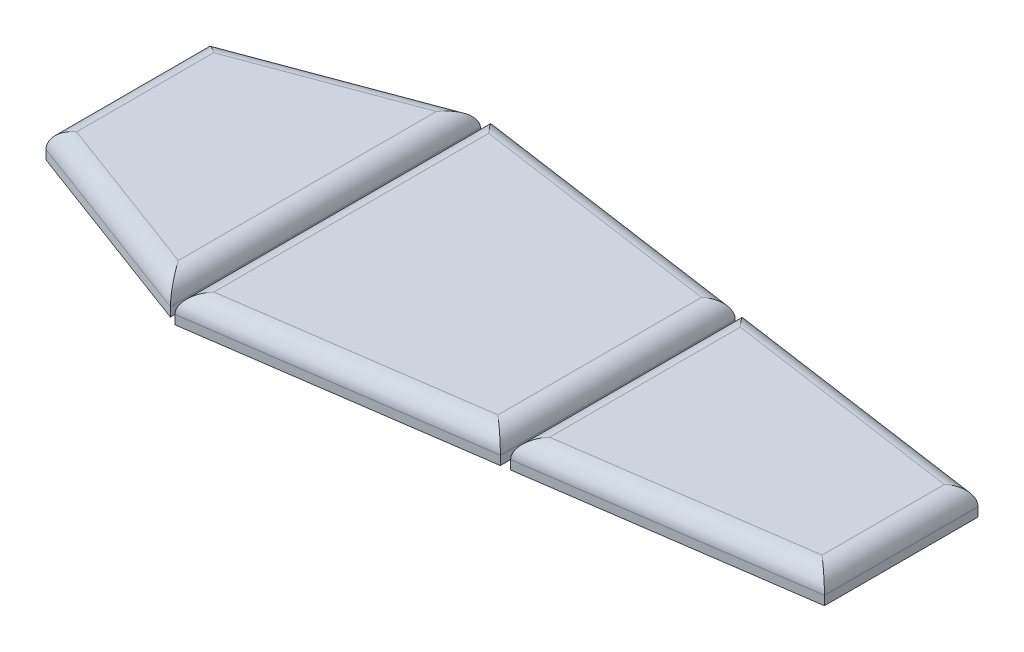
ISO-10303-21;
HEADER;
FILE_DESCRIPTION(('STEP AP214'),'2;1');
FILE_NAME('part.step','',(''),(''),'','','');
FILE_SCHEMA(('AUTOMOTIVE_DESIGN { 1 0 10303 214 1 1 1 1 }'));
ENDSEC;
DATA;
#1=APPLICATION_CONTEXT('core data for automotive mechanical design processes');
#2=APPLICATION_PROTOCOL_DEFINITION('international standard','automotive_design',2000,#1);
#3=PRODUCT_CONTEXT('',#1,'mechanical');
#4=PRODUCT('Part','Part','',(#3));
#5=PRODUCT_RELATED_PRODUCT_CATEGORY('part','',(#4));
#6=PRODUCT_DEFINITION_FORMATION('','',#4);
#7=PRODUCT_DEFINITION_CONTEXT('part definition',#1,'design');
#8=PRODUCT_DEFINITION('design','',#6,#7);
#9=PRODUCT_DEFINITION_SHAPE('','',#8);
#10=(LENGTH_UNIT() NAMED_UNIT(*) SI_UNIT(.MILLI.,.METRE.));
#11=(NAMED_UNIT(*) PLANE_ANGLE_UNIT() SI_UNIT($,.RADIAN.));
#12=(NAMED_UNIT(*) SI_UNIT($,.STERADIAN.) SOLID_ANGLE_UNIT());
#13=UNCERTAINTY_MEASURE_WITH_UNIT(LENGTH_MEASURE(1.E-05),#10,'distance_accuracy_value','');
#14=(GEOMETRIC_REPRESENTATION_CONTEXT(3) GLOBAL_UNCERTAINTY_ASSIGNED_CONTEXT((#13)) GLOBAL_UNIT_ASSIGNED_CONTEXT((#10,
#11,#12)) REPRESENTATION_CONTEXT('',''));
#15=CARTESIAN_POINT('',(0.,0.,0.));
#16=DIRECTION('',(0.,0.,1.));
#17=DIRECTION('',(1.,0.,0.));
#18=AXIS2_PLACEMENT_3D('',#15,#16,#17);
#19=CARTESIAN_POINT('',(1036.27166865944,90.4875,-224.07477234005));
#20=DIRECTION('',(-0.141933027229114,0.,0.98987626286399));
#21=DIRECTION('',(0.98987626286399,0.,0.141933027229114));
#22=AXIS2_PLACEMENT_3D('',#19,#20,#21);
#23=PLANE('',#22);
#24=DIRECTION('',(0.,-1.,0.));
#25=VECTOR('',#24,1.);
#26=CARTESIAN_POINT('',(263.1666865591,90.4875,-334.926132850436));
#27=LINE('',#26,#25);
#28=CARTESIAN_POINT('',(263.1666865591,39.6875,-334.926132850436));
#29=VERTEX_POINT('',#28);
#30=CARTESIAN_POINT('',(263.1666865591,14.2875,-334.926132850436));
#31=VERTEX_POINT('',#30);
#32=EDGE_CURVE('E95',#29,#31,#27,.T.);
#33=ORIENTED_EDGE('',*,*,#32,.F.);
#34=DIRECTION('',(-0.98987626286399,0.,-0.141933027229114));
#35=VECTOR('',#34,1.);
#36=CARTESIAN_POINT('',(1036.27166865944,39.6875,-224.07477234005));
#37=LINE('',#36,#35);
#38=CARTESIAN_POINT('',(1036.27166865944,39.6875,-224.07477234005));
#39=VERTEX_POINT('',#38);
#40=EDGE_CURVE('E53',#29,#39,#37,.F.);
#41=ORIENTED_EDGE('',*,*,#40,.T.);
#42=DIRECTION('',(0.,-1.,0.));
#43=VECTOR('',#42,1.);
#44=CARTESIAN_POINT('',(1036.27166865944,90.4875,-224.07477234005));
#45=LINE('',#44,#43);
#46=CARTESIAN_POINT('',(1036.27166865944,14.2875,-224.07477234005));
#47=VERTEX_POINT('',#46);
#48=EDGE_CURVE('E112',#39,#47,#45,.T.);
#49=ORIENTED_EDGE('',*,*,#48,.T.);
#50=DIRECTION('',(-0.98987626286399,0.,-0.141933027229114));
#51=VECTOR('',#50,1.);
#52=CARTESIAN_POINT('',(1036.27166865944,14.2875,-224.07477234005));
#53=LINE('',#52,#51);
#54=EDGE_CURVE('E108',#47,#31,#53,.T.);
#55=ORIENTED_EDGE('',*,*,#54,.T.);
#56=EDGE_LOOP('',(#33,#41,#49,#55));
#57=FACE_BOUND('',#56,.T.);
#58=ADVANCED_FACE('F44',(#57),#23,.F.);
#59=CARTESIAN_POINT('',(263.1666865591,90.4875,-334.926132850436));
#60=DIRECTION('',(1.,0.,0.));
#61=DIRECTION('',(0.,0.,-1.));
#62=AXIS2_PLACEMENT_3D('',#59,#60,#61);
#63=PLANE('',#62);
#64=DIRECTION('',(0.,-1.,0.));
#65=VECTOR('',#64,1.);
#66=CARTESIAN_POINT('',(263.166686559101,90.4875,319.413226746626));
#67=LINE('',#66,#65);
#68=CARTESIAN_POINT('',(263.166686559101,39.6875,319.413226746626));
#69=VERTEX_POINT('',#68);
#70=CARTESIAN_POINT('',(263.166686559101,14.2875,319.413226746626));
#71=VERTEX_POINT('',#70);
#72=EDGE_CURVE('E102',#69,#71,#67,.T.);
#73=ORIENTED_EDGE('',*,*,#72,.F.);
#74=DIRECTION('',(0.,0.,1.));
#75=VECTOR('',#74,1.);
#76=CARTESIAN_POINT('',(263.1666865591,39.6875,-334.926132850436));
#77=LINE('',#76,#75);
#78=EDGE_CURVE('E12',#69,#29,#77,.F.);
#79=ORIENTED_EDGE('',*,*,#78,.T.);
#80=ORIENTED_EDGE('',*,*,#32,.T.);
#81=DIRECTION('',(0.,0.,1.));
#82=VECTOR('',#81,1.);
#83=CARTESIAN_POINT('',(263.1666865591,14.2875,-334.926132850436));
#84=LINE('',#83,#82);
#85=EDGE_CURVE('E98',#31,#71,#84,.T.);
#86=ORIENTED_EDGE('',*,*,#85,.T.);
#87=EDGE_LOOP('',(#73,#79,#80,#86));
#88=FACE_BOUND('',#87,.T.);
#89=ADVANCED_FACE('F97',(#88),#63,.F.);
#90=CARTESIAN_POINT('',(263.166686559101,90.4875,319.413226746626));
#91=DIRECTION('',(-0.141942353510418,0.,-0.989874925573895));
#92=DIRECTION('',(-0.989874925573895,0.,0.141942353510418));
#93=AXIS2_PLACEMENT_3D('',#90,#91,#92);
#94=PLANE('',#93);
#95=DIRECTION('',(0.,-1.,0.));
#96=VECTOR('',#95,1.);
#97=CARTESIAN_POINT('',(1036.27166865944,90.4875,208.554432534488));
#98=LINE('',#97,#96);
#99=CARTESIAN_POINT('',(1036.27166865944,39.6875,208.554432534488));
#100=VERTEX_POINT('',#99);
#101=CARTESIAN_POINT('',(1036.27166865944,14.2875,208.554432534488));
#102=VERTEX_POINT('',#101);
#103=EDGE_CURVE('E122',#100,#102,#98,.T.);
#104=ORIENTED_EDGE('',*,*,#103,.F.);
#105=DIRECTION('',(0.989874925573895,0.,-0.141942353510418));
#106=VECTOR('',#105,1.);
#107=CARTESIAN_POINT('',(263.166686559101,39.6875,319.413226746626));
#108=LINE('',#107,#106);
#109=EDGE_CURVE('E133',#100,#69,#108,.F.);
#110=ORIENTED_EDGE('',*,*,#109,.T.);
#111=ORIENTED_EDGE('',*,*,#72,.T.);
#112=DIRECTION('',(0.989874925573895,0.,-0.141942353510418));
#113=VECTOR('',#112,1.);
#114=CARTESIAN_POINT('',(263.166686559101,14.2875,319.413226746626));
#115=LINE('',#114,#113);
#116=EDGE_CURVE('E110',#71,#102,#115,.T.);
#117=ORIENTED_EDGE('',*,*,#116,.T.);
#118=EDGE_LOOP('',(#104,#110,#111,#117));
#119=FACE_BOUND('',#118,.T.);
#120=ADVANCED_FACE('F162',(#119),#94,.F.);
#121=CARTESIAN_POINT('',(1036.27166865944,90.4875,208.554432534488));
#122=DIRECTION('',(-1.,0.,0.));
#123=DIRECTION('',(0.,0.,1.));
#124=AXIS2_PLACEMENT_3D('',#121,#122,#123);
#125=PLANE('',#124);
#126=ORIENTED_EDGE('',*,*,#48,.F.);
#127=DIRECTION('',(0.,0.,-1.));
#128=VECTOR('',#127,1.);
#129=CARTESIAN_POINT('',(1036.27166865944,39.6875,208.554432534488));
#130=LINE('',#129,#128);
#131=EDGE_CURVE('E136',#39,#100,#130,.F.);
#132=ORIENTED_EDGE('',*,*,#131,.T.);
#133=ORIENTED_EDGE('',*,*,#103,.T.);
#134=DIRECTION('',(0.,0.,-1.));
#135=VECTOR('',#134,1.);
#136=CARTESIAN_POINT('',(1036.27166865944,14.2875,208.554432534488));
#137=LINE('',#136,#135);
#138=EDGE_CURVE('E119',#102,#47,#137,.T.);
#139=ORIENTED_EDGE('',*,*,#138,.T.);
#140=EDGE_LOOP('',(#126,#132,#133,#139));
#141=FACE_BOUND('',#140,.T.);
#142=ADVANCED_FACE('F164',(#141),#125,.F.);
#143=CARTESIAN_POINT('',(0.,90.4875,0.));
#144=DIRECTION('',(0.,1.,0.));
#145=DIRECTION('',(0.,0.,1.));
#146=AXIS2_PLACEMENT_3D('',#143,#144,#145);
#147=PLANE('',#146);
#148=DIRECTION('',(0.,0.,1.));
#149=VECTOR('',#148,1.);
#150=CARTESIAN_POINT('',(313.966686559101,90.4875,319.413226746626));
#151=LINE('',#150,#149);
#152=CARTESIAN_POINT('',(313.9666865591,90.4875,-276.322648799411));
#153=VERTEX_POINT('',#152);
#154=CARTESIAN_POINT('',(313.966686559101,90.4875,260.809184902959));
#155=VERTEX_POINT('',#154);
#156=EDGE_CURVE('E101',#153,#155,#151,.T.);
#157=ORIENTED_EDGE('',*,*,#156,.T.);
#158=DIRECTION('',(0.989874925573895,0.,-0.141942353510418));
#159=VECTOR('',#158,1.);
#160=CARTESIAN_POINT('',(1029.06099710111,90.4875,158.268786315334));
#161=LINE('',#160,#159);
#162=CARTESIAN_POINT('',(985.471668659438,90.4875,164.519244536975));
#163=VERTEX_POINT('',#162);
#164=EDGE_CURVE('E130',#155,#163,#161,.T.);
#165=ORIENTED_EDGE('',*,*,#164,.T.);
#166=DIRECTION('',(0.,0.,-1.));
#167=VECTOR('',#166,1.);
#168=CARTESIAN_POINT('',(985.471668659438,90.4875,-224.07477234005));
#169=LINE('',#168,#167);
#170=CARTESIAN_POINT('',(985.471668659438,90.4875,-180.039165212101));
#171=VERTEX_POINT('',#170);
#172=EDGE_CURVE('E128',#163,#171,#169,.T.);
#173=ORIENTED_EDGE('',*,*,#172,.T.);
#174=DIRECTION('',(-0.98987626286399,0.,-0.141933027229114));
#175=VECTOR('',#174,1.);
#176=CARTESIAN_POINT('',(255.956488775862,90.4875,-284.640418696946));
#177=LINE('',#176,#175);
#178=EDGE_CURVE('E126',#171,#153,#177,.T.);
#179=ORIENTED_EDGE('',*,*,#178,.T.);
#180=EDGE_LOOP('',(#157,#165,#173,#179));
#181=FACE_BOUND('',#180,.T.);
#182=ADVANCED_FACE('F154',(#181),#147,.T.);
#183=CARTESIAN_POINT('',(0.,14.2875,0.));
#184=DIRECTION('',(0.,1.,0.));
#185=DIRECTION('',(0.,0.,1.));
#186=AXIS2_PLACEMENT_3D('',#183,#184,#185);
#187=PLANE('',#186);
#188=ORIENTED_EDGE('',*,*,#54,.F.);
#189=ORIENTED_EDGE('',*,*,#138,.F.);
#190=ORIENTED_EDGE('',*,*,#116,.F.);
#191=ORIENTED_EDGE('',*,*,#85,.F.);
#192=EDGE_LOOP('',(#188,#189,#190,#191));
#193=FACE_BOUND('',#192,.T.);
#194=ADVANCED_FACE('F106',(#193),#187,.F.);
#195=CARTESIAN_POINT('',(45.1471179964496,39.6875,-314.867239245625));
#196=DIRECTION('',(0.98987626286399,0.,0.141933027229114));
#197=DIRECTION('',(0.141933027229114,0.,-0.98987626286399));
#198=AXIS2_PLACEMENT_3D('',#195,#196,#197);
#199=CYLINDRICAL_SURFACE('',#198,50.8);
#200=CARTESIAN_POINT('',(985.471668659438,39.6875,-180.039165212101));
#201=DIRECTION('',(0.655006478124792,0.,0.755623261694978));
#202=DIRECTION('',(0.755623261694978,0.,-0.655006478124792));
#203=AXIS2_PLACEMENT_3D('',#200,#201,#202);
#204=ELLIPSE('',#203,67.2292696310697,50.8);
#205=EDGE_CURVE('E116',#39,#171,#204,.T.);
#206=ORIENTED_EDGE('',*,*,#205,.F.);
#207=ORIENTED_EDGE('',*,*,#40,.F.);
#208=CARTESIAN_POINT('',(313.966686559101,39.6875,-276.322648799411));
#209=DIRECTION('',(0.755623261694978,0.,-0.655006478124792));
#210=DIRECTION('',(-0.655006478124792,0.,-0.755623261694978));
#211=AXIS2_PLACEMENT_3D('',#208,#209,#210);
#212=ELLIPSE('',#211,77.5564848540652,50.8);
#213=EDGE_CURVE('E48',#153,#29,#212,.F.);
#214=ORIENTED_EDGE('',*,*,#213,.F.);
#215=ORIENTED_EDGE('',*,*,#178,.F.);
#216=EDGE_LOOP('',(#206,#207,#214,#215));
#217=FACE_BOUND('',#216,.T.);
#218=ADVANCED_FACE('F46',(#217),#199,.T.);
#219=CARTESIAN_POINT('',(313.966686559101,39.6875,0.));
#220=DIRECTION('',(0.,0.,-1.));
#221=DIRECTION('',(-1.,0.,0.));
#222=AXIS2_PLACEMENT_3D('',#219,#220,#221);
#223=CYLINDRICAL_SURFACE('',#222,50.8);
#224=ORIENTED_EDGE('',*,*,#213,.T.);
#225=ORIENTED_EDGE('',*,*,#78,.F.);
#226=CARTESIAN_POINT('',(313.966686559101,39.6875,260.809184902959));
#227=DIRECTION('',(-0.755626347314074,0.,-0.655002918500972));
#228=DIRECTION('',(0.655002918500972,0.,-0.755626347314074));
#229=AXIS2_PLACEMENT_3D('',#226,#227,#228);
#230=ELLIPSE('',#229,77.5569063360206,50.8);
#231=EDGE_CURVE('E141',#155,#69,#230,.F.);
#232=ORIENTED_EDGE('',*,*,#231,.F.);
#233=ORIENTED_EDGE('',*,*,#156,.F.);
#234=EDGE_LOOP('',(#224,#225,#232,#233));
#235=FACE_BOUND('',#234,.T.);
#236=ADVANCED_FACE('F184',(#235),#223,.T.);
#237=CARTESIAN_POINT('',(985.471668659438,39.6875,0.));
#238=DIRECTION('',(0.,0.,1.));
#239=DIRECTION('',(1.,0.,0.));
#240=AXIS2_PLACEMENT_3D('',#237,#238,#239);
#241=CYLINDRICAL_SURFACE('',#240,50.8);
#242=ORIENTED_EDGE('',*,*,#205,.T.);
#243=ORIENTED_EDGE('',*,*,#172,.F.);
#244=CARTESIAN_POINT('',(985.471668659438,39.6875,164.519244536975));
#245=DIRECTION('',(-0.655002918500972,0.,0.755626347314074));
#246=DIRECTION('',(0.755626347314074,0.,0.655002918500972));
#247=AXIS2_PLACEMENT_3D('',#244,#245,#246);
#248=ELLIPSE('',#247,67.228995098665,50.8);
#249=EDGE_CURVE('E139',#100,#163,#248,.T.);
#250=ORIENTED_EDGE('',*,*,#249,.F.);
#251=ORIENTED_EDGE('',*,*,#131,.F.);
#252=EDGE_LOOP('',(#242,#243,#250,#251));
#253=FACE_BOUND('',#252,.T.);
#254=ADVANCED_FACE('F147',(#253),#241,.T.);
#255=CARTESIAN_POINT('',(42.9707257612677,39.6875,299.668442243133));
#256=DIRECTION('',(-0.989874925573895,0.,0.141942353510418));
#257=DIRECTION('',(0.141942353510418,0.,0.989874925573895));
#258=AXIS2_PLACEMENT_3D('',#255,#256,#257);
#259=CYLINDRICAL_SURFACE('',#258,50.8);
#260=ORIENTED_EDGE('',*,*,#231,.T.);
#261=ORIENTED_EDGE('',*,*,#109,.F.);
#262=ORIENTED_EDGE('',*,*,#249,.T.);
#263=ORIENTED_EDGE('',*,*,#164,.F.);
#264=EDGE_LOOP('',(#260,#261,#262,#263));
#265=FACE_BOUND('',#264,.T.);
#266=ADVANCED_FACE('F158',(#265),#259,.T.);
#267=CLOSED_SHELL('',(#58,#89,#120,#142,#182,#194,#218,#236,#254,#266));
#268=MANIFOLD_SOLID_BREP('B2',#267);
#269=CARTESIAN_POINT('',(237.7666865591,90.4875,-338.568102081206));
#270=DIRECTION('',(-0.141933027229114,0.,0.98987626286399));
#271=DIRECTION('',(0.989876262863991,0.,0.141933027229114));
#272=AXIS2_PLACEMENT_3D('',#269,#270,#271);
#273=PLANE('',#272);
#274=DIRECTION('',(0.,-1.,0.));
#275=VECTOR('',#274,1.);
#276=CARTESIAN_POINT('',(-563.928331340562,90.4875,-453.518833878511));
#277=LINE('',#276,#275);
#278=CARTESIAN_POINT('',(-563.928331340562,39.6875,-453.518833878511));
#279=VERTEX_POINT('',#278);
#280=CARTESIAN_POINT('',(-563.928331340562,14.2875,-453.518833878511));
#281=VERTEX_POINT('',#280);
#282=EDGE_CURVE('E311',#279,#281,#277,.T.);
#283=ORIENTED_EDGE('',*,*,#282,.F.);
#284=DIRECTION('',(-0.989876262863991,0.,-0.141933027229114));
#285=VECTOR('',#284,1.);
#286=CARTESIAN_POINT('',(237.766686559101,39.6875,-338.568102081206));
#287=LINE('',#286,#285);
#288=CARTESIAN_POINT('',(237.7666865591,39.6875,-338.568102081206));
#289=VERTEX_POINT('',#288);
#290=EDGE_CURVE('E353',#279,#289,#287,.F.);
#291=ORIENTED_EDGE('',*,*,#290,.T.);
#292=DIRECTION('',(0.,-1.,0.));
#293=VECTOR('',#292,1.);
#294=CARTESIAN_POINT('',(237.7666865591,90.4875,-338.568102081206));
#295=LINE('',#294,#293);
#296=CARTESIAN_POINT('',(237.7666865591,14.2875,-338.568102081206));
#297=VERTEX_POINT('',#296);
#298=EDGE_CURVE('E332',#289,#297,#295,.T.);
#299=ORIENTED_EDGE('',*,*,#298,.T.);
#300=DIRECTION('',(-0.98987626286399,0.,-0.141933027229114));
#301=VECTOR('',#300,1.);
#302=CARTESIAN_POINT('',(237.7666865591,14.2875,-338.568102081206));
#303=LINE('',#302,#301);
#304=EDGE_CURVE('E328',#297,#281,#303,.T.);
#305=ORIENTED_EDGE('',*,*,#304,.T.);
#306=EDGE_LOOP('',(#283,#291,#299,#305));
#307=FACE_BOUND('',#306,.T.);
#308=ADVANCED_FACE('F257',(#307),#273,.F.);
#309=CARTESIAN_POINT('',(-563.928331340562,90.4875,-453.518833878511));
#310=DIRECTION('',(1.,0.,0.));
#311=DIRECTION('',(0.,0.,-1.));
#312=AXIS2_PLACEMENT_3D('',#309,#310,#311);
#313=PLANE('',#312);
#314=DIRECTION('',(0.,-1.,0.));
#315=VECTOR('',#314,1.);
#316=CARTESIAN_POINT('',(-563.928331340562,90.4875,438.013880611411));
#317=LINE('',#316,#315);
#318=CARTESIAN_POINT('',(-563.928331340562,39.6875,438.013880611411));
#319=VERTEX_POINT('',#318);
#320=CARTESIAN_POINT('',(-563.928331340562,14.2875,438.013880611411));
#321=VERTEX_POINT('',#320);
#322=EDGE_CURVE('E322',#319,#321,#317,.T.);
#323=ORIENTED_EDGE('',*,*,#322,.F.);
#324=DIRECTION('',(0.,0.,1.));
#325=VECTOR('',#324,1.);
#326=CARTESIAN_POINT('',(-563.928331340562,39.6875,-453.518833878511));
#327=LINE('',#326,#325);
#328=EDGE_CURVE('E42',#319,#279,#327,.F.);
#329=ORIENTED_EDGE('',*,*,#328,.T.);
#330=ORIENTED_EDGE('',*,*,#282,.T.);
#331=DIRECTION('',(0.,0.,1.));
#332=VECTOR('',#331,1.);
#333=CARTESIAN_POINT('',(-563.928331340562,14.2875,-453.518833878511));
#334=LINE('',#333,#332);
#335=EDGE_CURVE('E314',#281,#321,#334,.T.);
#336=ORIENTED_EDGE('',*,*,#335,.T.);
#337=EDGE_LOOP('',(#323,#329,#330,#336));
#338=FACE_BOUND('',#337,.T.);
#339=ADVANCED_FACE('F313',(#338),#313,.F.);
#340=CARTESIAN_POINT('',(-563.928331340562,90.4875,438.013880611411));
#341=DIRECTION('',(-0.141942353510418,0.,-0.989874925573895));
#342=DIRECTION('',(-0.989874925573895,0.,0.141942353510418));
#343=AXIS2_PLACEMENT_3D('',#340,#341,#342);
#344=PLANE('',#343);
#345=DIRECTION('',(0.,-1.,0.));
#346=VECTOR('',#345,1.);
#347=CARTESIAN_POINT('',(237.7666865591,90.4875,323.055440208165));
#348=LINE('',#347,#346);
#349=CARTESIAN_POINT('',(237.7666865591,39.6875,323.055440208165));
#350=VERTEX_POINT('',#349);
#351=CARTESIAN_POINT('',(237.7666865591,14.2875,323.055440208165));
#352=VERTEX_POINT('',#351);
#353=EDGE_CURVE('E342',#350,#352,#348,.T.);
#354=ORIENTED_EDGE('',*,*,#353,.F.);
#355=DIRECTION('',(0.989874925573895,0.,-0.141942353510418));
#356=VECTOR('',#355,1.);
#357=CARTESIAN_POINT('',(-563.928331340562,39.6875,438.013880611411));
#358=LINE('',#357,#356);
#359=EDGE_CURVE('E266',#350,#319,#358,.F.);
#360=ORIENTED_EDGE('',*,*,#359,.T.);
#361=ORIENTED_EDGE('',*,*,#322,.T.);
#362=DIRECTION('',(0.989874925573895,0.,-0.141942353510418));
#363=VECTOR('',#362,1.);
#364=CARTESIAN_POINT('',(-563.928331340562,14.2875,438.013880611411));
#365=LINE('',#364,#363);
#366=EDGE_CURVE('E330',#321,#352,#365,.T.);
#367=ORIENTED_EDGE('',*,*,#366,.T.);
#368=EDGE_LOOP('',(#354,#360,#361,#367));
#369=FACE_BOUND('',#368,.T.);
#370=ADVANCED_FACE('F377',(#369),#344,.F.);
#371=CARTESIAN_POINT('',(237.7666865591,90.4875,323.055440208165));
#372=DIRECTION('',(-1.,0.,0.));
#373=DIRECTION('',(0.,0.,1.));
#374=AXIS2_PLACEMENT_3D('',#371,#372,#373);
#375=PLANE('',#374);
#376=ORIENTED_EDGE('',*,*,#298,.F.);
#377=DIRECTION('',(0.,0.,-1.));
#378=VECTOR('',#377,1.);
#379=CARTESIAN_POINT('',(237.7666865591,39.6875,323.055440208165));
#380=LINE('',#379,#378);
#381=EDGE_CURVE('E281',#289,#350,#380,.F.);
#382=ORIENTED_EDGE('',*,*,#381,.T.);
#383=ORIENTED_EDGE('',*,*,#353,.T.);
#384=DIRECTION('',(0.,0.,-1.));
#385=VECTOR('',#384,1.);
#386=CARTESIAN_POINT('',(237.7666865591,14.2875,323.055440208165));
#387=LINE('',#386,#385);
#388=EDGE_CURVE('E339',#352,#297,#387,.T.);
#389=ORIENTED_EDGE('',*,*,#388,.T.);
#390=EDGE_LOOP('',(#376,#382,#383,#389));
#391=FACE_BOUND('',#390,.T.);
#392=ADVANCED_FACE('F376',(#391),#375,.F.);
#393=CARTESIAN_POINT('',(0.,90.4875,0.));
#394=DIRECTION('',(0.,1.,0.));
#395=DIRECTION('',(0.,0.,1.));
#396=AXIS2_PLACEMENT_3D('',#393,#394,#395);
#397=PLANE('',#396);
#398=DIRECTION('',(0.,0.,-1.));
#399=VECTOR('',#398,1.);
#400=CARTESIAN_POINT('',(186.966686559101,90.4875,-338.568102081206));
#401=LINE('',#400,#399);
#402=CARTESIAN_POINT('',(186.966686559101,90.4875,279.020252210651));
#403=VERTEX_POINT('',#402);
#404=CARTESIAN_POINT('',(186.966686559101,90.4875,-294.532494953257));
#405=VERTEX_POINT('',#404);
#406=EDGE_CURVE('E348',#403,#405,#401,.T.);
#407=ORIENTED_EDGE('',*,*,#406,.T.);
#408=DIRECTION('',(-0.989876262863991,0.,-0.141933027229114));
#409=VECTOR('',#408,1.);
#410=CARTESIAN_POINT('',(-571.138529123801,90.4875,-403.23311972502));
#411=LINE('',#410,#409);
#412=CARTESIAN_POINT('',(-513.128331340562,90.4875,-394.915349827485));
#413=VERTEX_POINT('',#412);
#414=EDGE_CURVE('E350',#405,#413,#411,.T.);
#415=ORIENTED_EDGE('',*,*,#414,.T.);
#416=DIRECTION('',(0.,0.,1.));
#417=VECTOR('',#416,1.);
#418=CARTESIAN_POINT('',(-513.128331340562,90.4875,438.013880611411));
#419=LINE('',#418,#417);
#420=CARTESIAN_POINT('',(-513.128331340562,90.4875,379.409838767744));
#421=VERTEX_POINT('',#420);
#422=EDGE_CURVE('E321',#413,#421,#419,.T.);
#423=ORIENTED_EDGE('',*,*,#422,.T.);
#424=DIRECTION('',(0.989874925573895,0.,-0.141942353510418));
#425=VECTOR('',#424,1.);
#426=CARTESIAN_POINT('',(230.556015000771,90.4875,272.769793989011));
#427=LINE('',#426,#425);
#428=EDGE_CURVE('E346',#421,#403,#427,.T.);
#429=ORIENTED_EDGE('',*,*,#428,.T.);
#430=EDGE_LOOP('',(#407,#415,#423,#429));
#431=FACE_BOUND('',#430,.T.);
#432=ADVANCED_FACE('F371',(#431),#397,.T.);
#433=CARTESIAN_POINT('',(0.,14.2875,0.));
#434=DIRECTION('',(0.,1.,0.));
#435=DIRECTION('',(0.,0.,1.));
#436=AXIS2_PLACEMENT_3D('',#433,#434,#435);
#437=PLANE('',#436);
#438=ORIENTED_EDGE('',*,*,#304,.F.);
#439=ORIENTED_EDGE('',*,*,#388,.F.);
#440=ORIENTED_EDGE('',*,*,#366,.F.);
#441=ORIENTED_EDGE('',*,*,#335,.F.);
#442=EDGE_LOOP('',(#438,#439,#440,#441));
#443=FACE_BOUND('',#442,.T.);
#444=ADVANCED_FACE('F326',(#443),#437,.F.);
#445=CARTESIAN_POINT('',(42.9707257612677,39.6875,299.668442243133));
#446=DIRECTION('',(-0.989874925573895,0.,0.141942353510418));
#447=DIRECTION('',(0.141942353510418,0.,0.989874925573895));
#448=AXIS2_PLACEMENT_3D('',#445,#446,#447);
#449=CYLINDRICAL_SURFACE('',#448,50.8);
#450=CARTESIAN_POINT('',(-513.128331340562,39.6875,379.409838767744));
#451=DIRECTION('',(-0.755626347314074,0.,-0.655002918500972));
#452=DIRECTION('',(0.655002918500972,0.,-0.755626347314074));
#453=AXIS2_PLACEMENT_3D('',#450,#451,#452);
#454=ELLIPSE('',#453,77.5569063360206,50.8);
#455=EDGE_CURVE('E336',#319,#421,#454,.T.);
#456=ORIENTED_EDGE('',*,*,#455,.F.);
#457=ORIENTED_EDGE('',*,*,#359,.F.);
#458=CARTESIAN_POINT('',(186.966686559101,39.6875,279.020252210651));
#459=DIRECTION('',(-0.655002918500972,0.,0.755626347314074));
#460=DIRECTION('',(-0.755626347314074,0.,-0.655002918500972));
#461=AXIS2_PLACEMENT_3D('',#458,#459,#460);
#462=ELLIPSE('',#461,67.228995098665,50.8);
#463=EDGE_CURVE('E261',#403,#350,#462,.F.);
#464=ORIENTED_EDGE('',*,*,#463,.F.);
#465=ORIENTED_EDGE('',*,*,#428,.F.);
#466=EDGE_LOOP('',(#456,#457,#464,#465));
#467=FACE_BOUND('',#466,.T.);
#468=ADVANCED_FACE('F259',(#467),#449,.T.);
#469=CARTESIAN_POINT('',(186.966686559101,39.6875,0.));
#470=DIRECTION('',(0.,0.,1.));
#471=DIRECTION('',(1.,0.,0.));
#472=AXIS2_PLACEMENT_3D('',#469,#470,#471);
#473=CYLINDRICAL_SURFACE('',#472,50.8);
#474=ORIENTED_EDGE('',*,*,#463,.T.);
#475=ORIENTED_EDGE('',*,*,#381,.F.);
#476=CARTESIAN_POINT('',(186.966686559101,39.6875,-294.532494953257));
#477=DIRECTION('',(0.655006478124792,0.,0.755623261694978));
#478=DIRECTION('',(-0.755623261694978,0.,0.655006478124792));
#479=AXIS2_PLACEMENT_3D('',#476,#477,#478);
#480=ELLIPSE('',#479,67.2292696310697,50.8);
#481=EDGE_CURVE('E359',#405,#289,#480,.F.);
#482=ORIENTED_EDGE('',*,*,#481,.F.);
#483=ORIENTED_EDGE('',*,*,#406,.F.);
#484=EDGE_LOOP('',(#474,#475,#482,#483));
#485=FACE_BOUND('',#484,.T.);
#486=ADVANCED_FACE('F394',(#485),#473,.T.);
#487=CARTESIAN_POINT('',(-513.128331340562,39.6875,0.));
#488=DIRECTION('',(0.,0.,-1.));
#489=DIRECTION('',(-1.,0.,0.));
#490=AXIS2_PLACEMENT_3D('',#487,#488,#489);
#491=CYLINDRICAL_SURFACE('',#490,50.8);
#492=ORIENTED_EDGE('',*,*,#455,.T.);
#493=ORIENTED_EDGE('',*,*,#422,.F.);
#494=CARTESIAN_POINT('',(-513.128331340562,39.6875,-394.915349827485));
#495=DIRECTION('',(0.755623261694978,0.,-0.655006478124792));
#496=DIRECTION('',(-0.655006478124792,0.,-0.755623261694978));
#497=AXIS2_PLACEMENT_3D('',#494,#495,#496);
#498=ELLIPSE('',#497,77.5564848540652,50.8);
#499=EDGE_CURVE('E357',#279,#413,#498,.T.);
#500=ORIENTED_EDGE('',*,*,#499,.F.);
#501=ORIENTED_EDGE('',*,*,#328,.F.);
#502=EDGE_LOOP('',(#492,#493,#500,#501));
#503=FACE_BOUND('',#502,.T.);
#504=ADVANCED_FACE('F364',(#503),#491,.T.);
#505=CARTESIAN_POINT('',(45.1471179964495,39.6875,-314.867239245625));
#506=DIRECTION('',(0.989876262863991,0.,0.141933027229114));
#507=DIRECTION('',(0.141933027229114,0.,-0.98987626286399));
#508=AXIS2_PLACEMENT_3D('',#505,#506,#507);
#509=CYLINDRICAL_SURFACE('',#508,50.8);
#510=ORIENTED_EDGE('',*,*,#481,.T.);
#511=ORIENTED_EDGE('',*,*,#290,.F.);
#512=ORIENTED_EDGE('',*,*,#499,.T.);
#513=ORIENTED_EDGE('',*,*,#414,.F.);
#514=EDGE_LOOP('',(#510,#511,#512,#513));
#515=FACE_BOUND('',#514,.T.);
#516=ADVANCED_FACE('F375',(#515),#509,.T.);
#517=CLOSED_SHELL('',(#308,#339,#370,#392,#432,#444,#468,#486,#504,#516));
#518=MANIFOLD_SOLID_BREP('B6',#517);
#519=CARTESIAN_POINT('',(-1148.12833134056,90.4875,217.313403671245));
#520=DIRECTION('',(1.,0.,0.));
#521=DIRECTION('',(0.,0.,-1.));
#522=AXIS2_PLACEMENT_3D('',#519,#520,#521);
#523=PLANE('',#522);
#524=DIRECTION('',(0.,-1.,0.));
#525=VECTOR('',#524,1.);
#526=CARTESIAN_POINT('',(-1148.12833134056,90.4875,217.313403671245));
#527=LINE('',#526,#525);
#528=CARTESIAN_POINT('',(-1148.12833134056,39.6875,217.313403671245));
#529=VERTEX_POINT('',#528);
#530=CARTESIAN_POINT('',(-1148.12833134056,14.2875,217.313403671245));
#531=VERTEX_POINT('',#530);
#532=EDGE_CURVE('E512',#529,#531,#527,.T.);
#533=ORIENTED_EDGE('',*,*,#532,.F.);
#534=DIRECTION('',(0.,0.,1.));
#535=VECTOR('',#534,1.);
#536=CARTESIAN_POINT('',(-1148.12833134056,39.6875,217.313403671245));
#537=LINE('',#536,#535);
#538=CARTESIAN_POINT('',(-1148.12833134056,39.6875,-239.454600148431));
#539=VERTEX_POINT('',#538);
#540=EDGE_CURVE('E255',#529,#539,#537,.F.);
#541=ORIENTED_EDGE('',*,*,#540,.T.);
#542=DIRECTION('',(0.,-1.,0.));
#543=VECTOR('',#542,1.);
#544=CARTESIAN_POINT('',(-1148.12833134056,90.4875,-239.454600148431));
#545=LINE('',#544,#543);
#546=CARTESIAN_POINT('',(-1148.12833134056,14.2875,-239.454600148431));
#547=VERTEX_POINT('',#546);
#548=EDGE_CURVE('E529',#539,#547,#545,.T.);
#549=ORIENTED_EDGE('',*,*,#548,.T.);
#550=DIRECTION('',(0.,0.,1.));
#551=VECTOR('',#550,1.);
#552=CARTESIAN_POINT('',(-1148.12833134056,14.2875,217.313403671245));
#553=LINE('',#552,#551);
#554=EDGE_CURVE('E525',#547,#531,#553,.T.);
#555=ORIENTED_EDGE('',*,*,#554,.T.);
#556=EDGE_LOOP('',(#533,#541,#549,#555));
#557=FACE_BOUND('',#556,.T.);
#558=ADVANCED_FACE('F461',(#557),#523,.F.);
#559=CARTESIAN_POINT('',(-589.328331340562,90.4875,425.648013671245));
#560=DIRECTION('',(0.349336089298276,0.,-0.936997490238788));
#561=DIRECTION('',(-0.936997490238788,0.,-0.349336089298276));
#562=AXIS2_PLACEMENT_3D('',#559,#560,#561);
#563=PLANE('',#562);
#564=DIRECTION('',(0.,-1.,0.));
#565=VECTOR('',#564,1.);
#566=CARTESIAN_POINT('',(-589.328331340562,90.4875,425.648013671245));
#567=LINE('',#566,#565);
#568=CARTESIAN_POINT('',(-589.328331340562,39.6875,425.648013671245));
#569=VERTEX_POINT('',#568);
#570=CARTESIAN_POINT('',(-589.328331340562,14.2875,425.648013671245));
#571=VERTEX_POINT('',#570);
#572=EDGE_CURVE('E519',#569,#571,#567,.T.);
#573=ORIENTED_EDGE('',*,*,#572,.F.);
#574=DIRECTION('',(0.936997490238788,0.,0.349336089298276));
#575=VECTOR('',#574,1.);
#576=CARTESIAN_POINT('',(-589.328331340562,39.6875,425.648013671245));
#577=LINE('',#576,#575);
#578=EDGE_CURVE('E470',#569,#529,#577,.F.);
#579=ORIENTED_EDGE('',*,*,#578,.T.);
#580=ORIENTED_EDGE('',*,*,#532,.T.);
#581=DIRECTION('',(0.936997490238788,0.,0.349336089298276));
#582=VECTOR('',#581,1.);
#583=CARTESIAN_POINT('',(-589.328331340562,14.2875,425.648013671245));
#584=LINE('',#583,#582);
#585=EDGE_CURVE('E515',#531,#571,#584,.T.);
#586=ORIENTED_EDGE('',*,*,#585,.T.);
#587=EDGE_LOOP('',(#573,#579,#580,#586));
#588=FACE_BOUND('',#587,.T.);
#589=ADVANCED_FACE('F514',(#588),#563,.F.);
#590=CARTESIAN_POINT('',(-589.328331340562,90.4875,-447.775240148431));
#591=DIRECTION('',(-1.,0.,0.));
#592=DIRECTION('',(0.,0.,1.));
#593=AXIS2_PLACEMENT_3D('',#590,#591,#592);
#594=PLANE('',#593);
#595=DIRECTION('',(0.,-1.,0.));
#596=VECTOR('',#595,1.);
#597=CARTESIAN_POINT('',(-589.328331340562,90.4875,-447.775240148431));
#598=LINE('',#597,#596);
#599=CARTESIAN_POINT('',(-589.328331340562,39.6875,-447.775240148431));
#600=VERTEX_POINT('',#599);
#601=CARTESIAN_POINT('',(-589.328331340562,14.2875,-447.775240148431));
#602=VERTEX_POINT('',#601);
#603=EDGE_CURVE('E539',#600,#602,#598,.T.);
#604=ORIENTED_EDGE('',*,*,#603,.F.);
#605=DIRECTION('',(0.,0.,-1.));
#606=VECTOR('',#605,1.);
#607=CARTESIAN_POINT('',(-589.328331340562,39.6875,-447.775240148431));
#608=LINE('',#607,#606);
#609=EDGE_CURVE('E550',#600,#569,#608,.F.);
#610=ORIENTED_EDGE('',*,*,#609,.T.);
#611=ORIENTED_EDGE('',*,*,#572,.T.);
#612=DIRECTION('',(0.,0.,-1.));
#613=VECTOR('',#612,1.);
#614=CARTESIAN_POINT('',(-589.328331340562,14.2875,-447.775240148431));
#615=LINE('',#614,#613);
#616=EDGE_CURVE('E527',#571,#602,#615,.T.);
#617=ORIENTED_EDGE('',*,*,#616,.T.);
#618=EDGE_LOOP('',(#604,#610,#611,#617));
#619=FACE_BOUND('',#618,.T.);
#620=ADVANCED_FACE('F579',(#619),#594,.F.);
#621=CARTESIAN_POINT('',(-1148.12833134056,90.4875,-239.454600148431));
#622=DIRECTION('',(0.349315522787269,0.,0.937005157691171));
#623=DIRECTION('',(0.937005157691172,0.,-0.349315522787269));
#624=AXIS2_PLACEMENT_3D('',#621,#622,#623);
#625=PLANE('',#624);
#626=ORIENTED_EDGE('',*,*,#548,.F.);
#627=DIRECTION('',(-0.937005157691172,0.,0.349315522787269));
#628=VECTOR('',#627,1.);
#629=CARTESIAN_POINT('',(-1148.12833134056,39.6875,-239.454600148431));
#630=LINE('',#629,#628);
#631=EDGE_CURVE('E553',#539,#600,#630,.F.);
#632=ORIENTED_EDGE('',*,*,#631,.T.);
#633=ORIENTED_EDGE('',*,*,#603,.T.);
#634=DIRECTION('',(-0.937005157691172,0.,0.349315522787269));
#635=VECTOR('',#634,1.);
#636=CARTESIAN_POINT('',(-1148.12833134056,14.2875,-239.454600148431));
#637=LINE('',#636,#635);
#638=EDGE_CURVE('E536',#602,#547,#637,.T.);
#639=ORIENTED_EDGE('',*,*,#638,.T.);
#640=EDGE_LOOP('',(#626,#632,#633,#639));
#641=FACE_BOUND('',#640,.T.);
#642=ADVANCED_FACE('F581',(#641),#625,.F.);
#643=CARTESIAN_POINT('',(0.,90.4875,0.));
#644=DIRECTION('',(0.,-1.,0.));
#645=DIRECTION('',(0.,0.,-1.));
#646=AXIS2_PLACEMENT_3D('',#643,#644,#645);
#647=PLANE('',#646);
#648=DIRECTION('',(0.936997490238788,0.,0.349336089298276));
#649=VECTOR('',#648,1.);
#650=CARTESIAN_POINT('',(-193.498927983459,90.4875,519.007384117102));
#651=LINE('',#650,#649);
#652=CARTESIAN_POINT('',(-1097.32833134056,90.4875,182.037186810489));
#653=VERTEX_POINT('',#652);
#654=CARTESIAN_POINT('',(-640.128331340562,90.4875,352.49277681049));
#655=VERTEX_POINT('',#654);
#656=EDGE_CURVE('E543',#653,#655,#651,.T.);
#657=ORIENTED_EDGE('',*,*,#656,.T.);
#658=DIRECTION('',(0.,0.,-1.));
#659=VECTOR('',#658,1.);
#660=CARTESIAN_POINT('',(-640.128331340562,90.4875,0.));
#661=LINE('',#660,#659);
#662=CARTESIAN_POINT('',(-640.128331340562,90.4875,-374.621716931449));
#663=VERTEX_POINT('',#662);
#664=EDGE_CURVE('E547',#655,#663,#661,.T.);
#665=ORIENTED_EDGE('',*,*,#664,.T.);
#666=DIRECTION('',(-0.937005157691172,0.,0.349315522787269));
#667=VECTOR('',#666,1.);
#668=CARTESIAN_POINT('',(-200.726914658316,90.4875,-538.43056507059));
#669=LINE('',#668,#667);
#670=CARTESIAN_POINT('',(-1097.32833134056,90.4875,-204.177556931449));
#671=VERTEX_POINT('',#670);
#672=EDGE_CURVE('E545',#663,#671,#669,.T.);
#673=ORIENTED_EDGE('',*,*,#672,.T.);
#674=DIRECTION('',(0.,0.,1.));
#675=VECTOR('',#674,1.);
#676=CARTESIAN_POINT('',(-1097.32833134056,90.4875,0.));
#677=LINE('',#676,#675);
#678=EDGE_CURVE('E518',#671,#653,#677,.T.);
#679=ORIENTED_EDGE('',*,*,#678,.T.);
#680=EDGE_LOOP('',(#657,#665,#673,#679));
#681=FACE_BOUND('',#680,.T.);
#682=ADVANCED_FACE('F571',(#681),#647,.F.);
#683=CARTESIAN_POINT('',(0.,14.2875,0.));
#684=DIRECTION('',(0.,-1.,0.));
#685=DIRECTION('',(0.,0.,-1.));
#686=AXIS2_PLACEMENT_3D('',#683,#684,#685);
#687=PLANE('',#686);
#688=ORIENTED_EDGE('',*,*,#554,.F.);
#689=ORIENTED_EDGE('',*,*,#638,.F.);
#690=ORIENTED_EDGE('',*,*,#616,.F.);
#691=ORIENTED_EDGE('',*,*,#585,.F.);
#692=EDGE_LOOP('',(#688,#689,#690,#691));
#693=FACE_BOUND('',#692,.T.);
#694=ADVANCED_FACE('F523',(#693),#687,.T.);
#695=CARTESIAN_POINT('',(-1097.32833134056,39.6875,0.));
#696=DIRECTION('',(0.,0.,1.));
#697=DIRECTION('',(1.,0.,0.));
#698=AXIS2_PLACEMENT_3D('',#695,#696,#697);
#699=CYLINDRICAL_SURFACE('',#698,50.8);
#700=CARTESIAN_POINT('',(-1097.32833134056,39.6875,-204.177556931449));
#701=DIRECTION('',(-0.570387796684296,0.,0.82137553006748));
#702=DIRECTION('',(0.82137553006748,0.,0.570387796684296));
#703=AXIS2_PLACEMENT_3D('',#700,#701,#702);
#704=ELLIPSE('',#703,61.8474718814992,50.8);
#705=EDGE_CURVE('E533',#539,#671,#704,.F.);
#706=ORIENTED_EDGE('',*,*,#705,.F.);
#707=ORIENTED_EDGE('',*,*,#540,.F.);
#708=CARTESIAN_POINT('',(-1097.32833134056,39.6875,182.037186810489));
#709=DIRECTION('',(0.570378782346312,0.,0.821381789820749));
#710=DIRECTION('',(-0.82138178982075,0.,0.570378782346312));
#711=AXIS2_PLACEMENT_3D('',#708,#709,#710);
#712=ELLIPSE('',#711,61.8470005417165,50.8);
#713=EDGE_CURVE('E465',#653,#529,#712,.T.);
#714=ORIENTED_EDGE('',*,*,#713,.F.);
#715=ORIENTED_EDGE('',*,*,#678,.F.);
#716=EDGE_LOOP('',(#706,#707,#714,#715));
#717=FACE_BOUND('',#716,.T.);
#718=ADVANCED_FACE('F463',(#717),#699,.T.);
#719=CARTESIAN_POINT('',(-193.498927983459,39.6875,519.007384117102));
#720=DIRECTION('',(0.936997490238788,0.,0.349336089298276));
#721=DIRECTION('',(0.349336089298276,0.,-0.936997490238788));
#722=AXIS2_PLACEMENT_3D('',#719,#720,#721);
#723=CYLINDRICAL_SURFACE('',#722,50.8);
#724=ORIENTED_EDGE('',*,*,#713,.T.);
#725=ORIENTED_EDGE('',*,*,#578,.F.);
#726=CARTESIAN_POINT('',(-640.128331340562,39.6875,352.49277681049));
#727=DIRECTION('',(0.82138178982075,0.,-0.570378782346312));
#728=DIRECTION('',(0.570378782346312,0.,0.821381789820749));
#729=AXIS2_PLACEMENT_3D('',#726,#727,#728);
#730=ELLIPSE('',#729,89.0636215306413,50.8);
#731=EDGE_CURVE('E558',#655,#569,#730,.T.);
#732=ORIENTED_EDGE('',*,*,#731,.F.);
#733=ORIENTED_EDGE('',*,*,#656,.F.);
#734=EDGE_LOOP('',(#724,#725,#732,#733));
#735=FACE_BOUND('',#734,.T.);
#736=ADVANCED_FACE('F601',(#735),#723,.T.);
#737=CARTESIAN_POINT('',(-200.726914658316,39.6875,-538.43056507059));
#738=DIRECTION('',(-0.937005157691172,0.,0.349315522787269));
#739=DIRECTION('',(0.349315522787269,0.,0.937005157691172));
#740=AXIS2_PLACEMENT_3D('',#737,#738,#739);
#741=CYLINDRICAL_SURFACE('',#740,50.8);
#742=ORIENTED_EDGE('',*,*,#705,.T.);
#743=ORIENTED_EDGE('',*,*,#672,.F.);
#744=CARTESIAN_POINT('',(-640.128331340562,39.6875,-374.621716931449));
#745=DIRECTION('',(-0.821375530067481,0.,-0.570387796684296));
#746=DIRECTION('',(-0.570387796684296,0.,0.82137553006748));
#747=AXIS2_PLACEMENT_3D('',#744,#745,#746);
#748=ELLIPSE('',#747,89.0622139802148,50.8);
#749=EDGE_CURVE('E556',#600,#663,#748,.F.);
#750=ORIENTED_EDGE('',*,*,#749,.F.);
#751=ORIENTED_EDGE('',*,*,#631,.F.);
#752=EDGE_LOOP('',(#742,#743,#750,#751));
#753=FACE_BOUND('',#752,.T.);
#754=ADVANCED_FACE('F564',(#753),#741,.T.);
#755=CARTESIAN_POINT('',(-640.128331340562,39.6875,0.));
#756=DIRECTION('',(0.,0.,-1.));
#757=DIRECTION('',(-1.,0.,0.));
#758=AXIS2_PLACEMENT_3D('',#755,#756,#757);
#759=CYLINDRICAL_SURFACE('',#758,50.8);
#760=ORIENTED_EDGE('',*,*,#731,.T.);
#761=ORIENTED_EDGE('',*,*,#609,.F.);
#762=ORIENTED_EDGE('',*,*,#749,.T.);
#763=ORIENTED_EDGE('',*,*,#664,.F.);
#764=EDGE_LOOP('',(#760,#761,#762,#763));
#765=FACE_BOUND('',#764,.T.);
#766=ADVANCED_FACE('F575',(#765),#759,.T.);
#767=CLOSED_SHELL('',(#558,#589,#620,#642,#682,#694,#718,#736,#754,#766));
#768=MANIFOLD_SOLID_BREP('B36',#767);
#769=ADVANCED_BREP_SHAPE_REPRESENTATION('',(#18,#268,#518,#768),#14);
#770=SHAPE_DEFINITION_REPRESENTATION(#9,#769);
ENDSEC;
END-ISO-10303-21;
